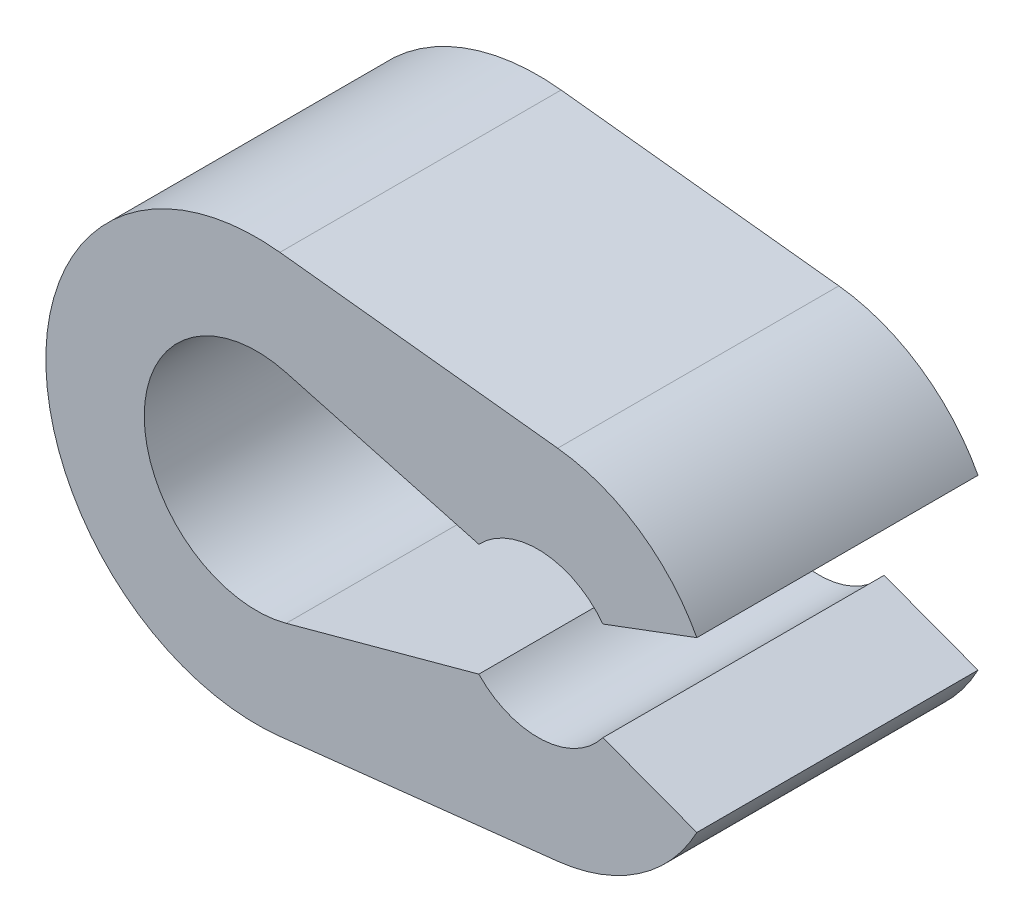
ISO-10303-21;
HEADER;
FILE_DESCRIPTION(('STEP AP214'),'2;1');
FILE_NAME('part.step','',(''),(''),'','','');
FILE_SCHEMA(('AUTOMOTIVE_DESIGN { 1 0 10303 214 1 1 1 1 }'));
ENDSEC;
DATA;
#1=APPLICATION_CONTEXT('core data for automotive mechanical design processes');
#2=APPLICATION_PROTOCOL_DEFINITION('international standard','automotive_design',2000,#1);
#3=PRODUCT_CONTEXT('',#1,'mechanical');
#4=PRODUCT('Part','Part','',(#3));
#5=PRODUCT_RELATED_PRODUCT_CATEGORY('part','',(#4));
#6=PRODUCT_DEFINITION_FORMATION('','',#4);
#7=PRODUCT_DEFINITION_CONTEXT('part definition',#1,'design');
#8=PRODUCT_DEFINITION('design','',#6,#7);
#9=PRODUCT_DEFINITION_SHAPE('','',#8);
#10=(LENGTH_UNIT() NAMED_UNIT(*) SI_UNIT(.MILLI.,.METRE.));
#11=(NAMED_UNIT(*) PLANE_ANGLE_UNIT() SI_UNIT($,.RADIAN.));
#12=(NAMED_UNIT(*) SI_UNIT($,.STERADIAN.) SOLID_ANGLE_UNIT());
#13=UNCERTAINTY_MEASURE_WITH_UNIT(LENGTH_MEASURE(1.E-05),#10,'distance_accuracy_value','');
#14=(GEOMETRIC_REPRESENTATION_CONTEXT(3) GLOBAL_UNCERTAINTY_ASSIGNED_CONTEXT((#13)) GLOBAL_UNIT_ASSIGNED_CONTEXT((#10,
#11,#12)) REPRESENTATION_CONTEXT('',''));
#15=CARTESIAN_POINT('',(0.,0.,0.));
#16=DIRECTION('',(0.,0.,1.));
#17=DIRECTION('',(1.,0.,0.));
#18=AXIS2_PLACEMENT_3D('',#15,#16,#17);
#19=CARTESIAN_POINT('',(0.704,6.36116215797083,10.));
#20=DIRECTION('',(0.11,0.993931587182941,0.));
#21=DIRECTION('',(-0.993931587182941,0.11,0.));
#22=AXIS2_PLACEMENT_3D('',#19,#20,#21);
#23=PLANE('',#22);
#24=DIRECTION('',(0.993931587182941,-0.11,0.));
#25=VECTOR('',#24,1.);
#26=CARTESIAN_POINT('',(0.704,6.36116215797083,0.));
#27=LINE('',#26,#25);
#28=CARTESIAN_POINT('',(-9.175,7.45448690387206,0.));
#29=VERTEX_POINT('',#28);
#30=CARTESIAN_POINT('',(0.704,6.36116215797083,0.));
#31=VERTEX_POINT('',#30);
#32=EDGE_CURVE('E154',#29,#31,#27,.T.);
#33=ORIENTED_EDGE('',*,*,#32,.F.);
#34=DIRECTION('',(0.,0.,-1.));
#35=VECTOR('',#34,1.);
#36=CARTESIAN_POINT('',(-9.175,7.45448690387206,10.));
#37=LINE('',#36,#35);
#38=CARTESIAN_POINT('',(-9.175,7.45448690387206,10.));
#39=VERTEX_POINT('',#38);
#40=EDGE_CURVE('E11',#39,#29,#37,.T.);
#41=ORIENTED_EDGE('',*,*,#40,.F.);
#42=DIRECTION('',(0.993931587182941,-0.11,0.));
#43=VECTOR('',#42,1.);
#44=CARTESIAN_POINT('',(0.704,6.36116215797083,10.));
#45=LINE('',#44,#43);
#46=CARTESIAN_POINT('',(0.704,6.36116215797083,10.));
#47=VERTEX_POINT('',#46);
#48=EDGE_CURVE('E183',#39,#47,#45,.T.);
#49=ORIENTED_EDGE('',*,*,#48,.T.);
#50=DIRECTION('',(0.,0.,-1.));
#51=VECTOR('',#50,1.);
#52=CARTESIAN_POINT('',(0.704,6.36116215797083,10.));
#53=LINE('',#52,#51);
#54=EDGE_CURVE('E97',#47,#31,#53,.T.);
#55=ORIENTED_EDGE('',*,*,#54,.T.);
#56=EDGE_LOOP('',(#33,#41,#49,#55));
#57=FACE_BOUND('',#56,.T.);
#58=ADVANCED_FACE('F35',(#57),#23,.T.);
#59=CARTESIAN_POINT('',(-10.,0.,10.));
#60=DIRECTION('',(0.,0.,-1.));
#61=DIRECTION('',(-1.,0.,0.));
#62=AXIS2_PLACEMENT_3D('',#59,#60,#61);
#63=CYLINDRICAL_SURFACE('',#62,7.5);
#64=CARTESIAN_POINT('',(-10.,0.,0.));
#65=DIRECTION('',(0.,0.,1.));
#66=DIRECTION('',(1.,0.,0.));
#67=AXIS2_PLACEMENT_3D('',#64,#65,#66);
#68=CIRCLE('',#67,7.5);
#69=CARTESIAN_POINT('',(-9.175,-7.45448690387206,0.));
#70=VERTEX_POINT('',#69);
#71=EDGE_CURVE('E157',#29,#70,#68,.T.);
#72=ORIENTED_EDGE('',*,*,#71,.T.);
#73=DIRECTION('',(0.,0.,-1.));
#74=VECTOR('',#73,1.);
#75=CARTESIAN_POINT('',(-9.175,-7.45448690387206,10.));
#76=LINE('',#75,#74);
#77=CARTESIAN_POINT('',(-9.175,-7.45448690387206,10.));
#78=VERTEX_POINT('',#77);
#79=EDGE_CURVE('E43',#78,#70,#76,.T.);
#80=ORIENTED_EDGE('',*,*,#79,.F.);
#81=CARTESIAN_POINT('',(-10.,0.,10.));
#82=DIRECTION('',(0.,0.,1.));
#83=DIRECTION('',(1.,0.,0.));
#84=AXIS2_PLACEMENT_3D('',#81,#82,#83);
#85=CIRCLE('',#84,7.5);
#86=EDGE_CURVE('E224',#39,#78,#85,.T.);
#87=ORIENTED_EDGE('',*,*,#86,.F.);
#88=ORIENTED_EDGE('',*,*,#40,.T.);
#89=EDGE_LOOP('',(#72,#80,#87,#88));
#90=FACE_BOUND('',#89,.T.);
#91=ADVANCED_FACE('F254',(#90),#63,.T.);
#92=CARTESIAN_POINT('',(0.704,-6.36116215797083,10.));
#93=DIRECTION('',(-0.11,0.993931587182941,0.));
#94=DIRECTION('',(-0.993931587182941,-0.11,0.));
#95=AXIS2_PLACEMENT_3D('',#92,#93,#94);
#96=PLANE('',#95);
#97=DIRECTION('',(0.993931587182941,0.11,0.));
#98=VECTOR('',#97,1.);
#99=CARTESIAN_POINT('',(0.704,-6.36116215797083,0.));
#100=LINE('',#99,#98);
#101=CARTESIAN_POINT('',(0.704,-6.36116215797083,0.));
#102=VERTEX_POINT('',#101);
#103=EDGE_CURVE('E159',#70,#102,#100,.T.);
#104=ORIENTED_EDGE('',*,*,#103,.T.);
#105=DIRECTION('',(0.,0.,-1.));
#106=VECTOR('',#105,1.);
#107=CARTESIAN_POINT('',(0.704,-6.36116215797083,10.));
#108=LINE('',#107,#106);
#109=CARTESIAN_POINT('',(0.704,-6.36116215797083,10.));
#110=VERTEX_POINT('',#109);
#111=EDGE_CURVE('E197',#110,#102,#108,.T.);
#112=ORIENTED_EDGE('',*,*,#111,.F.);
#113=DIRECTION('',(0.993931587182941,0.11,0.));
#114=VECTOR('',#113,1.);
#115=CARTESIAN_POINT('',(0.704,-6.36116215797083,10.));
#116=LINE('',#115,#114);
#117=EDGE_CURVE('E206',#78,#110,#116,.T.);
#118=ORIENTED_EDGE('',*,*,#117,.F.);
#119=ORIENTED_EDGE('',*,*,#79,.T.);
#120=EDGE_LOOP('',(#104,#112,#118,#119));
#121=FACE_BOUND('',#120,.T.);
#122=ADVANCED_FACE('F204',(#121),#96,.F.);
#123=CARTESIAN_POINT('',(0.,0.,10.));
#124=DIRECTION('',(0.,0.,-1.));
#125=DIRECTION('',(-1.,0.,0.));
#126=AXIS2_PLACEMENT_3D('',#123,#124,#125);
#127=CYLINDRICAL_SURFACE('',#126,6.4);
#128=CARTESIAN_POINT('',(0.,0.,0.));
#129=DIRECTION('',(0.,0.,1.));
#130=DIRECTION('',(1.,0.,0.));
#131=AXIS2_PLACEMENT_3D('',#128,#129,#130);
#132=CIRCLE('',#131,6.4);
#133=CARTESIAN_POINT('',(5.65331761004103,-3.,0.));
#134=VERTEX_POINT('',#133);
#135=EDGE_CURVE('E161',#102,#134,#132,.T.);
#136=ORIENTED_EDGE('',*,*,#135,.T.);
#137=DIRECTION('',(0.,0.,-1.));
#138=VECTOR('',#137,1.);
#139=CARTESIAN_POINT('',(5.65331761004103,-3.,10.));
#140=LINE('',#139,#138);
#141=CARTESIAN_POINT('',(5.65331761004103,-3.,10.));
#142=VERTEX_POINT('',#141);
#143=EDGE_CURVE('E195',#142,#134,#140,.T.);
#144=ORIENTED_EDGE('',*,*,#143,.F.);
#145=CARTESIAN_POINT('',(0.,0.,10.));
#146=DIRECTION('',(0.,0.,1.));
#147=DIRECTION('',(1.,0.,0.));
#148=AXIS2_PLACEMENT_3D('',#145,#146,#147);
#149=CIRCLE('',#148,6.4);
#150=EDGE_CURVE('E218',#110,#142,#149,.T.);
#151=ORIENTED_EDGE('',*,*,#150,.F.);
#152=ORIENTED_EDGE('',*,*,#111,.T.);
#153=EDGE_LOOP('',(#136,#144,#151,#152));
#154=FACE_BOUND('',#153,.T.);
#155=ADVANCED_FACE('F215',(#154),#127,.T.);
#156=CARTESIAN_POINT('',(-0.290391819736106,-0.776124732633886,10.));
#157=DIRECTION('',(0.350430420809077,0.936588767908079,0.));
#158=DIRECTION('',(-0.936588767908079,0.350430420809077,0.));
#159=AXIS2_PLACEMENT_3D('',#156,#157,#158);
#160=PLANE('',#159);
#161=DIRECTION('',(0.936588767908079,-0.350430420809077,0.));
#162=VECTOR('',#161,1.);
#163=CARTESIAN_POINT('',(-0.290391819736106,-0.776124732633886,0.));
#164=LINE('',#163,#162);
#165=CARTESIAN_POINT('',(2.31246621596943,-1.75,0.));
#166=VERTEX_POINT('',#165);
#167=EDGE_CURVE('E164',#166,#134,#164,.T.);
#168=ORIENTED_EDGE('',*,*,#167,.F.);
#169=DIRECTION('',(0.,0.,-1.));
#170=VECTOR('',#169,1.);
#171=CARTESIAN_POINT('',(2.31246621596943,-1.75,10.));
#172=LINE('',#171,#170);
#173=CARTESIAN_POINT('',(2.31246621596943,-1.75,10.));
#174=VERTEX_POINT('',#173);
#175=EDGE_CURVE('E193',#174,#166,#172,.T.);
#176=ORIENTED_EDGE('',*,*,#175,.F.);
#177=DIRECTION('',(0.936588767908079,-0.350430420809077,0.));
#178=VECTOR('',#177,1.);
#179=CARTESIAN_POINT('',(-0.290391819736106,-0.776124732633886,10.));
#180=LINE('',#179,#178);
#181=EDGE_CURVE('E220',#174,#142,#180,.T.);
#182=ORIENTED_EDGE('',*,*,#181,.T.);
#183=ORIENTED_EDGE('',*,*,#143,.T.);
#184=EDGE_LOOP('',(#168,#176,#182,#183));
#185=FACE_BOUND('',#184,.T.);
#186=ADVANCED_FACE('F322',(#185),#160,.T.);
#187=CARTESIAN_POINT('',(0.,0.,10.));
#188=DIRECTION('',(0.,0.,-1.));
#189=DIRECTION('',(-1.,0.,0.));
#190=AXIS2_PLACEMENT_3D('',#187,#188,#189);
#191=CYLINDRICAL_SURFACE('',#190,2.9);
#192=CARTESIAN_POINT('',(0.,0.,0.));
#193=DIRECTION('',(0.,0.,1.));
#194=DIRECTION('',(1.,0.,0.));
#195=AXIS2_PLACEMENT_3D('',#192,#193,#194);
#196=CIRCLE('',#195,2.9);
#197=CARTESIAN_POINT('',(-2.1,-2.,0.));
#198=VERTEX_POINT('',#197);
#199=EDGE_CURVE('E167',#198,#166,#196,.T.);
#200=ORIENTED_EDGE('',*,*,#199,.F.);
#201=DIRECTION('',(0.,0.,-1.));
#202=VECTOR('',#201,1.);
#203=CARTESIAN_POINT('',(-2.1,-2.,10.));
#204=LINE('',#203,#202);
#205=CARTESIAN_POINT('',(-2.1,-2.,10.));
#206=VERTEX_POINT('',#205);
#207=EDGE_CURVE('E191',#206,#198,#204,.T.);
#208=ORIENTED_EDGE('',*,*,#207,.F.);
#209=CARTESIAN_POINT('',(0.,0.,10.));
#210=DIRECTION('',(0.,0.,1.));
#211=DIRECTION('',(1.,0.,0.));
#212=AXIS2_PLACEMENT_3D('',#209,#210,#211);
#213=CIRCLE('',#212,2.9);
#214=EDGE_CURVE('E222',#206,#174,#213,.T.);
#215=ORIENTED_EDGE('',*,*,#214,.T.);
#216=ORIENTED_EDGE('',*,*,#175,.T.);
#217=EDGE_LOOP('',(#200,#208,#215,#216));
#218=FACE_BOUND('',#217,.T.);
#219=ADVANCED_FACE('F313',(#218),#191,.F.);
#220=CARTESIAN_POINT('',(0.361549169542915,-1.3317061078164,10.));
#221=DIRECTION('',(-0.262008733624454,0.965065502183406,0.));
#222=DIRECTION('',(-0.965065502183406,-0.262008733624454,0.));
#223=AXIS2_PLACEMENT_3D('',#220,#221,#222);
#224=PLANE('',#223);
#225=DIRECTION('',(0.965065502183406,0.262008733624454,0.));
#226=VECTOR('',#225,1.);
#227=CARTESIAN_POINT('',(0.361549169542915,-1.3317061078164,0.));
#228=LINE('',#227,#226);
#229=CARTESIAN_POINT('',(-8.95196506550218,-3.86026200873362,0.));
#230=VERTEX_POINT('',#229);
#231=EDGE_CURVE('E170',#230,#198,#228,.T.);
#232=ORIENTED_EDGE('',*,*,#231,.F.);
#233=DIRECTION('',(0.,0.,-1.));
#234=VECTOR('',#233,1.);
#235=CARTESIAN_POINT('',(-8.95196506550218,-3.86026200873362,10.));
#236=LINE('',#235,#234);
#237=CARTESIAN_POINT('',(-8.95196506550218,-3.86026200873362,10.));
#238=VERTEX_POINT('',#237);
#239=EDGE_CURVE('E189',#238,#230,#236,.T.);
#240=ORIENTED_EDGE('',*,*,#239,.F.);
#241=DIRECTION('',(0.965065502183406,0.262008733624454,0.));
#242=VECTOR('',#241,1.);
#243=CARTESIAN_POINT('',(0.361549169542915,-1.3317061078164,10.));
#244=LINE('',#243,#242);
#245=EDGE_CURVE('E230',#238,#206,#244,.T.);
#246=ORIENTED_EDGE('',*,*,#245,.T.);
#247=ORIENTED_EDGE('',*,*,#207,.T.);
#248=EDGE_LOOP('',(#232,#240,#246,#247));
#249=FACE_BOUND('',#248,.T.);
#250=ADVANCED_FACE('F240',(#249),#224,.T.);
#251=CARTESIAN_POINT('',(-10.,0.,10.));
#252=DIRECTION('',(0.,0.,-1.));
#253=DIRECTION('',(-1.,0.,0.));
#254=AXIS2_PLACEMENT_3D('',#251,#252,#253);
#255=CYLINDRICAL_SURFACE('',#254,4.);
#256=CARTESIAN_POINT('',(-10.,0.,0.));
#257=DIRECTION('',(0.,0.,1.));
#258=DIRECTION('',(1.,0.,0.));
#259=AXIS2_PLACEMENT_3D('',#256,#257,#258);
#260=CIRCLE('',#259,4.);
#261=CARTESIAN_POINT('',(-8.95196506550218,3.86026200873362,0.));
#262=VERTEX_POINT('',#261);
#263=EDGE_CURVE('E173',#262,#230,#260,.T.);
#264=ORIENTED_EDGE('',*,*,#263,.F.);
#265=DIRECTION('',(0.,0.,-1.));
#266=VECTOR('',#265,1.);
#267=CARTESIAN_POINT('',(-8.95196506550218,3.86026200873362,10.));
#268=LINE('',#267,#266);
#269=CARTESIAN_POINT('',(-8.95196506550218,3.86026200873362,10.));
#270=VERTEX_POINT('',#269);
#271=EDGE_CURVE('E187',#270,#262,#268,.T.);
#272=ORIENTED_EDGE('',*,*,#271,.F.);
#273=CARTESIAN_POINT('',(-10.,0.,10.));
#274=DIRECTION('',(0.,0.,1.));
#275=DIRECTION('',(1.,0.,0.));
#276=AXIS2_PLACEMENT_3D('',#273,#274,#275);
#277=CIRCLE('',#276,4.);
#278=EDGE_CURVE('E149',#270,#238,#277,.T.);
#279=ORIENTED_EDGE('',*,*,#278,.T.);
#280=ORIENTED_EDGE('',*,*,#239,.T.);
#281=EDGE_LOOP('',(#264,#272,#279,#280));
#282=FACE_BOUND('',#281,.T.);
#283=ADVANCED_FACE('F235',(#282),#255,.F.);
#284=CARTESIAN_POINT('',(0.361549169542915,1.3317061078164,10.));
#285=DIRECTION('',(0.262008733624454,0.965065502183406,0.));
#286=DIRECTION('',(-0.965065502183406,0.262008733624454,0.));
#287=AXIS2_PLACEMENT_3D('',#284,#285,#286);
#288=PLANE('',#287);
#289=DIRECTION('',(0.965065502183406,-0.262008733624454,0.));
#290=VECTOR('',#289,1.);
#291=CARTESIAN_POINT('',(0.361549169542915,1.3317061078164,0.));
#292=LINE('',#291,#290);
#293=CARTESIAN_POINT('',(-2.1,2.,0.));
#294=VERTEX_POINT('',#293);
#295=EDGE_CURVE('E176',#262,#294,#292,.T.);
#296=ORIENTED_EDGE('',*,*,#295,.T.);
#297=DIRECTION('',(0.,0.,-1.));
#298=VECTOR('',#297,1.);
#299=CARTESIAN_POINT('',(-2.1,2.,10.));
#300=LINE('',#299,#298);
#301=CARTESIAN_POINT('',(-2.1,2.,10.));
#302=VERTEX_POINT('',#301);
#303=EDGE_CURVE('E137',#302,#294,#300,.T.);
#304=ORIENTED_EDGE('',*,*,#303,.F.);
#305=DIRECTION('',(0.965065502183406,-0.262008733624454,0.));
#306=VECTOR('',#305,1.);
#307=CARTESIAN_POINT('',(0.361549169542915,1.3317061078164,10.));
#308=LINE('',#307,#306);
#309=EDGE_CURVE('E146',#270,#302,#308,.T.);
#310=ORIENTED_EDGE('',*,*,#309,.F.);
#311=ORIENTED_EDGE('',*,*,#271,.T.);
#312=EDGE_LOOP('',(#296,#304,#310,#311));
#313=FACE_BOUND('',#312,.T.);
#314=ADVANCED_FACE('F244',(#313),#288,.F.);
#315=CARTESIAN_POINT('',(0.,0.,10.));
#316=DIRECTION('',(0.,0.,-1.));
#317=DIRECTION('',(-1.,0.,0.));
#318=AXIS2_PLACEMENT_3D('',#315,#316,#317);
#319=CYLINDRICAL_SURFACE('',#318,2.9);
#320=CARTESIAN_POINT('',(0.,0.,0.));
#321=DIRECTION('',(0.,0.,1.));
#322=DIRECTION('',(1.,0.,0.));
#323=AXIS2_PLACEMENT_3D('',#320,#321,#322);
#324=CIRCLE('',#323,2.9);
#325=CARTESIAN_POINT('',(2.31246621596943,1.75,0.));
#326=VERTEX_POINT('',#325);
#327=EDGE_CURVE('E136',#326,#294,#324,.T.);
#328=ORIENTED_EDGE('',*,*,#327,.F.);
#329=DIRECTION('',(0.,0.,-1.));
#330=VECTOR('',#329,1.);
#331=CARTESIAN_POINT('',(2.31246621596943,1.75,10.));
#332=LINE('',#331,#330);
#333=CARTESIAN_POINT('',(2.31246621596943,1.75,10.));
#334=VERTEX_POINT('',#333);
#335=EDGE_CURVE('E130',#334,#326,#332,.T.);
#336=ORIENTED_EDGE('',*,*,#335,.F.);
#337=CARTESIAN_POINT('',(0.,0.,10.));
#338=DIRECTION('',(0.,0.,1.));
#339=DIRECTION('',(1.,0.,0.));
#340=AXIS2_PLACEMENT_3D('',#337,#338,#339);
#341=CIRCLE('',#340,2.9);
#342=EDGE_CURVE('E134',#334,#302,#341,.T.);
#343=ORIENTED_EDGE('',*,*,#342,.T.);
#344=ORIENTED_EDGE('',*,*,#303,.T.);
#345=EDGE_LOOP('',(#328,#336,#343,#344));
#346=FACE_BOUND('',#345,.T.);
#347=ADVANCED_FACE('F132',(#346),#319,.F.);
#348=CARTESIAN_POINT('',(-0.290391819736106,0.776124732633886,10.));
#349=DIRECTION('',(-0.350430420809077,0.936588767908079,0.));
#350=DIRECTION('',(-0.936588767908079,-0.350430420809077,0.));
#351=AXIS2_PLACEMENT_3D('',#348,#349,#350);
#352=PLANE('',#351);
#353=DIRECTION('',(0.936588767908079,0.350430420809077,0.));
#354=VECTOR('',#353,1.);
#355=CARTESIAN_POINT('',(-0.290391819736106,0.776124732633886,0.));
#356=LINE('',#355,#354);
#357=CARTESIAN_POINT('',(5.65331761004103,3.,0.));
#358=VERTEX_POINT('',#357);
#359=EDGE_CURVE('E90',#326,#358,#356,.T.);
#360=ORIENTED_EDGE('',*,*,#359,.T.);
#361=DIRECTION('',(0.,0.,-1.));
#362=VECTOR('',#361,1.);
#363=CARTESIAN_POINT('',(5.65331761004103,3.,10.));
#364=LINE('',#363,#362);
#365=CARTESIAN_POINT('',(5.65331761004103,3.,10.));
#366=VERTEX_POINT('',#365);
#367=EDGE_CURVE('E138',#366,#358,#364,.T.);
#368=ORIENTED_EDGE('',*,*,#367,.F.);
#369=DIRECTION('',(0.936588767908079,0.350430420809077,0.));
#370=VECTOR('',#369,1.);
#371=CARTESIAN_POINT('',(-0.290391819736106,0.776124732633886,10.));
#372=LINE('',#371,#370);
#373=EDGE_CURVE('E140',#334,#366,#372,.T.);
#374=ORIENTED_EDGE('',*,*,#373,.F.);
#375=ORIENTED_EDGE('',*,*,#335,.T.);
#376=EDGE_LOOP('',(#360,#368,#374,#375));
#377=FACE_BOUND('',#376,.T.);
#378=ADVANCED_FACE('F141',(#377),#352,.F.);
#379=CARTESIAN_POINT('',(0.,0.,10.));
#380=DIRECTION('',(0.,0.,-1.));
#381=DIRECTION('',(-1.,0.,0.));
#382=AXIS2_PLACEMENT_3D('',#379,#380,#381);
#383=CYLINDRICAL_SURFACE('',#382,6.4);
#384=CARTESIAN_POINT('',(0.,0.,0.));
#385=DIRECTION('',(0.,0.,1.));
#386=DIRECTION('',(1.,0.,0.));
#387=AXIS2_PLACEMENT_3D('',#384,#385,#386);
#388=CIRCLE('',#387,6.4);
#389=EDGE_CURVE('E181',#358,#31,#388,.T.);
#390=ORIENTED_EDGE('',*,*,#389,.T.);
#391=ORIENTED_EDGE('',*,*,#54,.F.);
#392=CARTESIAN_POINT('',(0.,0.,10.));
#393=DIRECTION('',(0.,0.,1.));
#394=DIRECTION('',(1.,0.,0.));
#395=AXIS2_PLACEMENT_3D('',#392,#393,#394);
#396=CIRCLE('',#395,6.4);
#397=EDGE_CURVE('E51',#366,#47,#396,.T.);
#398=ORIENTED_EDGE('',*,*,#397,.F.);
#399=ORIENTED_EDGE('',*,*,#367,.T.);
#400=EDGE_LOOP('',(#390,#391,#398,#399));
#401=FACE_BOUND('',#400,.T.);
#402=ADVANCED_FACE('F260',(#401),#383,.T.);
#403=CARTESIAN_POINT('',(0.,0.,10.));
#404=DIRECTION('',(0.,0.,1.));
#405=DIRECTION('',(1.,0.,0.));
#406=AXIS2_PLACEMENT_3D('',#403,#404,#405);
#407=PLANE('',#406);
#408=ORIENTED_EDGE('',*,*,#48,.F.);
#409=ORIENTED_EDGE('',*,*,#86,.T.);
#410=ORIENTED_EDGE('',*,*,#117,.T.);
#411=ORIENTED_EDGE('',*,*,#150,.T.);
#412=ORIENTED_EDGE('',*,*,#181,.F.);
#413=ORIENTED_EDGE('',*,*,#214,.F.);
#414=ORIENTED_EDGE('',*,*,#245,.F.);
#415=ORIENTED_EDGE('',*,*,#278,.F.);
#416=ORIENTED_EDGE('',*,*,#309,.T.);
#417=ORIENTED_EDGE('',*,*,#342,.F.);
#418=ORIENTED_EDGE('',*,*,#373,.T.);
#419=ORIENTED_EDGE('',*,*,#397,.T.);
#420=EDGE_LOOP('',(#408,#409,#410,#411,#412,#413,#414,#415,#416,#417,#418,#419));
#421=FACE_BOUND('',#420,.T.);
#422=ADVANCED_FACE('F143',(#421),#407,.T.);
#423=CARTESIAN_POINT('',(0.,0.,0.));
#424=DIRECTION('',(0.,0.,1.));
#425=DIRECTION('',(1.,0.,0.));
#426=AXIS2_PLACEMENT_3D('',#423,#424,#425);
#427=PLANE('',#426);
#428=ORIENTED_EDGE('',*,*,#32,.T.);
#429=ORIENTED_EDGE('',*,*,#389,.F.);
#430=ORIENTED_EDGE('',*,*,#359,.F.);
#431=ORIENTED_EDGE('',*,*,#327,.T.);
#432=ORIENTED_EDGE('',*,*,#295,.F.);
#433=ORIENTED_EDGE('',*,*,#263,.T.);
#434=ORIENTED_EDGE('',*,*,#231,.T.);
#435=ORIENTED_EDGE('',*,*,#199,.T.);
#436=ORIENTED_EDGE('',*,*,#167,.T.);
#437=ORIENTED_EDGE('',*,*,#135,.F.);
#438=ORIENTED_EDGE('',*,*,#103,.F.);
#439=ORIENTED_EDGE('',*,*,#71,.F.);
#440=EDGE_LOOP('',(#428,#429,#430,#431,#432,#433,#434,#435,#436,#437,#438,#439));
#441=FACE_BOUND('',#440,.T.);
#442=ADVANCED_FACE('F211',(#441),#427,.F.);
#443=CLOSED_SHELL('',(#58,#91,#122,#155,#186,#219,#250,#283,#314,#347,#378,#402,#422,#442));
#444=MANIFOLD_SOLID_BREP('B2',#443);
#445=ADVANCED_BREP_SHAPE_REPRESENTATION('',(#18,#444),#14);
#446=SHAPE_DEFINITION_REPRESENTATION(#9,#445);
ENDSEC;
END-ISO-10303-21;
